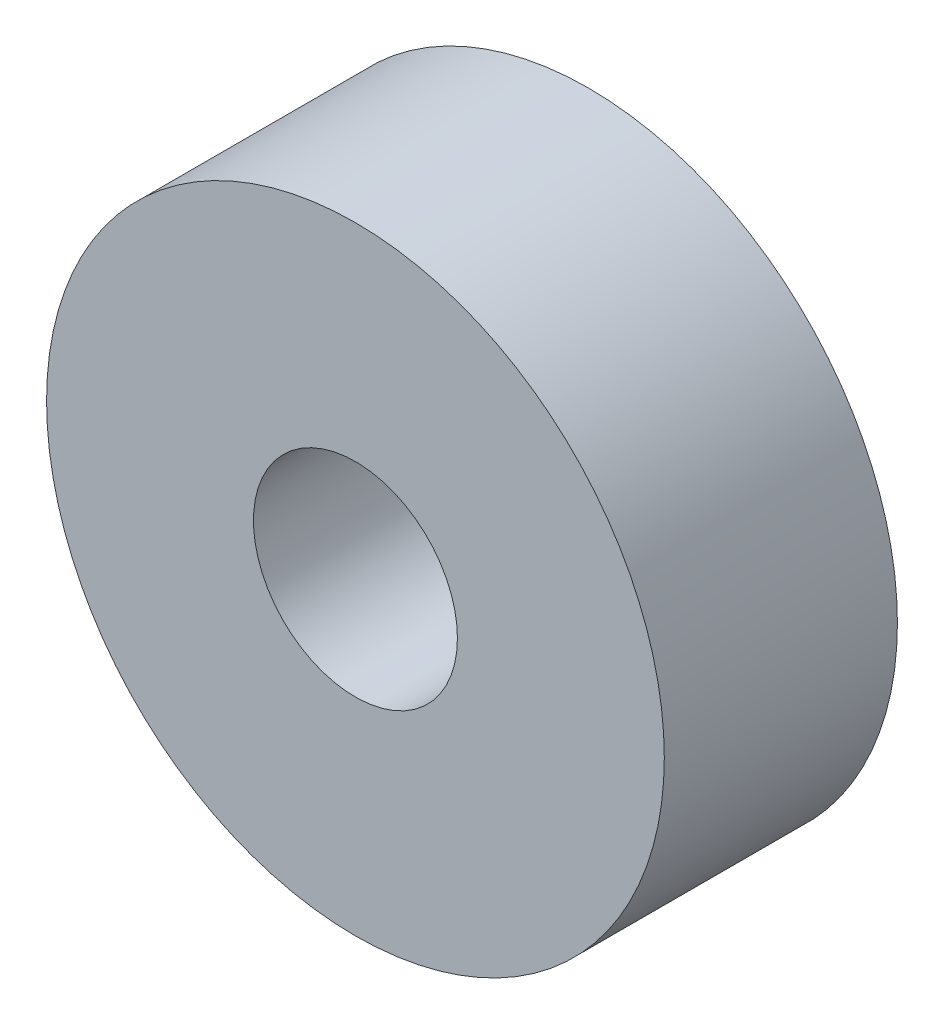
ISO-10303-21;
HEADER;
FILE_DESCRIPTION(('STEP AP214'),'2;1');
FILE_NAME('part.step','',(''),(''),'','','');
FILE_SCHEMA(('AUTOMOTIVE_DESIGN { 1 0 10303 214 1 1 1 1 }'));
ENDSEC;
DATA;
#1=APPLICATION_CONTEXT('core data for automotive mechanical design processes');
#2=APPLICATION_PROTOCOL_DEFINITION('international standard','automotive_design',2000,#1);
#3=PRODUCT_CONTEXT('',#1,'mechanical');
#4=PRODUCT('Part','Part','',(#3));
#5=PRODUCT_RELATED_PRODUCT_CATEGORY('part','',(#4));
#6=PRODUCT_DEFINITION_FORMATION('','',#4);
#7=PRODUCT_DEFINITION_CONTEXT('part definition',#1,'design');
#8=PRODUCT_DEFINITION('design','',#6,#7);
#9=PRODUCT_DEFINITION_SHAPE('','',#8);
#10=(LENGTH_UNIT() NAMED_UNIT(*) SI_UNIT(.MILLI.,.METRE.));
#11=(NAMED_UNIT(*) PLANE_ANGLE_UNIT() SI_UNIT($,.RADIAN.));
#12=(NAMED_UNIT(*) SI_UNIT($,.STERADIAN.) SOLID_ANGLE_UNIT());
#13=UNCERTAINTY_MEASURE_WITH_UNIT(LENGTH_MEASURE(1.E-05),#10,'distance_accuracy_value','');
#14=(GEOMETRIC_REPRESENTATION_CONTEXT(3) GLOBAL_UNCERTAINTY_ASSIGNED_CONTEXT((#13)) GLOBAL_UNIT_ASSIGNED_CONTEXT((#10,
#11,#12)) REPRESENTATION_CONTEXT('',''));
#15=CARTESIAN_POINT('',(0.,0.,0.));
#16=DIRECTION('',(0.,0.,1.));
#17=DIRECTION('',(1.,0.,0.));
#18=AXIS2_PLACEMENT_3D('',#15,#16,#17);
#19=CARTESIAN_POINT('',(0.,0.,80.));
#20=DIRECTION('',(0.,0.,1.));
#21=DIRECTION('',(1.,0.,0.));
#22=AXIS2_PLACEMENT_3D('',#19,#20,#21);
#23=PLANE('',#22);
#24=CARTESIAN_POINT('',(0.,0.,80.));
#25=DIRECTION('',(0.,0.,1.));
#26=DIRECTION('',(1.,0.,0.));
#27=AXIS2_PLACEMENT_3D('',#24,#25,#26);
#28=CIRCLE('',#27,106.);
#29=CARTESIAN_POINT('',(106.,0.,80.));
#30=VERTEX_POINT('',#29);
#31=EDGE_CURVE('E10',#30,#30,#28,.T.);
#32=ORIENTED_EDGE('',*,*,#31,.T.);
#33=EDGE_LOOP('',(#32));
#34=FACE_BOUND('',#33,.T.);
#35=CARTESIAN_POINT('',(0.,0.,80.));
#36=DIRECTION('',(0.,0.,1.));
#37=DIRECTION('',(1.,0.,0.));
#38=AXIS2_PLACEMENT_3D('',#35,#36,#37);
#39=CIRCLE('',#38,35.);
#40=CARTESIAN_POINT('',(35.,0.,80.));
#41=VERTEX_POINT('',#40);
#42=EDGE_CURVE('E43',#41,#41,#39,.T.);
#43=ORIENTED_EDGE('',*,*,#42,.F.);
#44=EDGE_LOOP('',(#43));
#45=FACE_BOUND('',#44,.T.);
#46=ADVANCED_FACE('F32',(#34,#45),#23,.T.);
#47=CARTESIAN_POINT('',(0.,0.,0.));
#48=DIRECTION('',(0.,0.,1.));
#49=DIRECTION('',(1.,0.,0.));
#50=AXIS2_PLACEMENT_3D('',#47,#48,#49);
#51=PLANE('',#50);
#52=CARTESIAN_POINT('',(0.,0.,0.));
#53=DIRECTION('',(0.,0.,1.));
#54=DIRECTION('',(1.,0.,0.));
#55=AXIS2_PLACEMENT_3D('',#52,#53,#54);
#56=CIRCLE('',#55,106.);
#57=CARTESIAN_POINT('',(106.,0.,0.));
#58=VERTEX_POINT('',#57);
#59=EDGE_CURVE('E36',#58,#58,#56,.T.);
#60=ORIENTED_EDGE('',*,*,#59,.F.);
#61=EDGE_LOOP('',(#60));
#62=FACE_BOUND('',#61,.T.);
#63=CARTESIAN_POINT('',(0.,0.,0.));
#64=DIRECTION('',(0.,0.,1.));
#65=DIRECTION('',(1.,0.,0.));
#66=AXIS2_PLACEMENT_3D('',#63,#64,#65);
#67=CIRCLE('',#66,35.);
#68=CARTESIAN_POINT('',(35.,0.,0.));
#69=VERTEX_POINT('',#68);
#70=EDGE_CURVE('E45',#69,#69,#67,.T.);
#71=ORIENTED_EDGE('',*,*,#70,.T.);
#72=EDGE_LOOP('',(#71));
#73=FACE_BOUND('',#72,.T.);
#74=ADVANCED_FACE('F55',(#62,#73),#51,.F.);
#75=CARTESIAN_POINT('',(0.,0.,80.));
#76=DIRECTION('',(0.,0.,-1.));
#77=DIRECTION('',(-1.,0.,0.));
#78=AXIS2_PLACEMENT_3D('',#75,#76,#77);
#79=CYLINDRICAL_SURFACE('',#78,106.);
#80=ORIENTED_EDGE('',*,*,#31,.F.);
#81=EDGE_LOOP('',(#80));
#82=FACE_BOUND('',#81,.T.);
#83=ORIENTED_EDGE('',*,*,#59,.T.);
#84=EDGE_LOOP('',(#83));
#85=FACE_BOUND('',#84,.T.);
#86=ADVANCED_FACE('F34',(#82,#85),#79,.T.);
#87=CARTESIAN_POINT('',(0.,0.,80.));
#88=DIRECTION('',(0.,0.,-1.));
#89=DIRECTION('',(-1.,0.,0.));
#90=AXIS2_PLACEMENT_3D('',#87,#88,#89);
#91=CYLINDRICAL_SURFACE('',#90,35.);
#92=ORIENTED_EDGE('',*,*,#42,.T.);
#93=EDGE_LOOP('',(#92));
#94=FACE_BOUND('',#93,.T.);
#95=ORIENTED_EDGE('',*,*,#70,.F.);
#96=EDGE_LOOP('',(#95));
#97=FACE_BOUND('',#96,.T.);
#98=ADVANCED_FACE('F51',(#94,#97),#91,.F.);
#99=CLOSED_SHELL('',(#46,#74,#86,#98));
#100=MANIFOLD_SOLID_BREP('B2',#99);
#101=ADVANCED_BREP_SHAPE_REPRESENTATION('',(#18,#100),#14);
#102=SHAPE_DEFINITION_REPRESENTATION(#9,#101);
ENDSEC;
END-ISO-10303-21;
